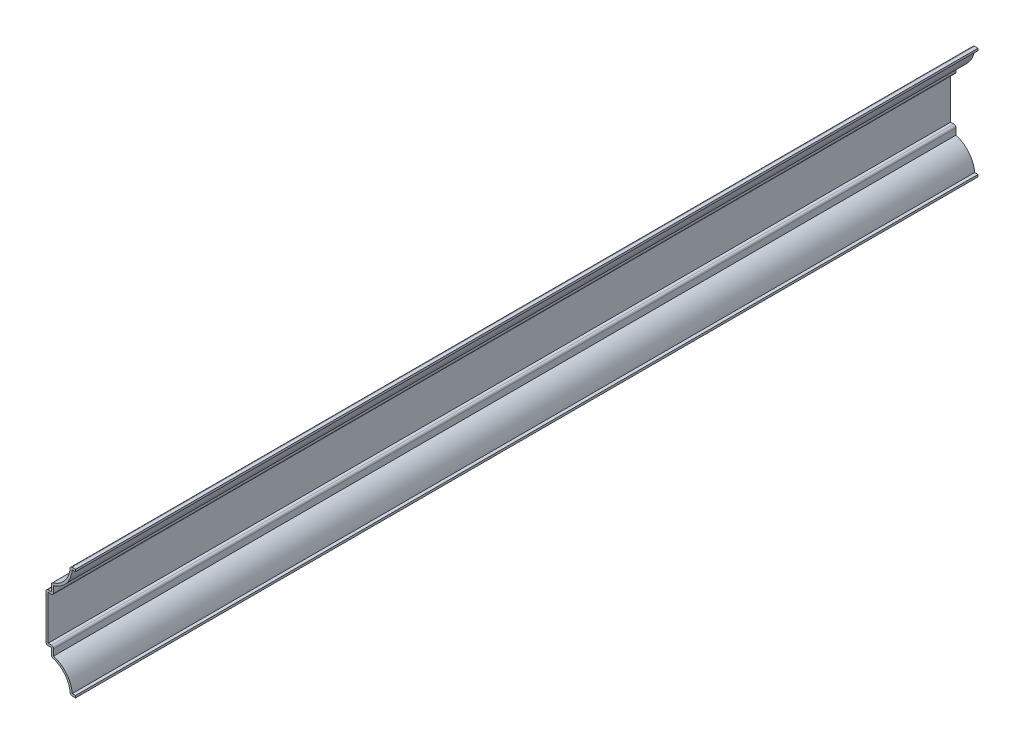
ISO-10303-21;
HEADER;
FILE_DESCRIPTION(('STEP AP214'),'2;1');
FILE_NAME('part.step','',(''),(''),'','','');
FILE_SCHEMA(('AUTOMOTIVE_DESIGN { 1 0 10303 214 1 1 1 1 }'));
ENDSEC;
DATA;
#1=APPLICATION_CONTEXT('core data for automotive mechanical design processes');
#2=APPLICATION_PROTOCOL_DEFINITION('international standard','automotive_design',2000,#1);
#3=PRODUCT_CONTEXT('',#1,'mechanical');
#4=PRODUCT('Part','Part','',(#3));
#5=PRODUCT_RELATED_PRODUCT_CATEGORY('part','',(#4));
#6=PRODUCT_DEFINITION_FORMATION('','',#4);
#7=PRODUCT_DEFINITION_CONTEXT('part definition',#1,'design');
#8=PRODUCT_DEFINITION('design','',#6,#7);
#9=PRODUCT_DEFINITION_SHAPE('','',#8);
#10=(LENGTH_UNIT() NAMED_UNIT(*) SI_UNIT(.MILLI.,.METRE.));
#11=(NAMED_UNIT(*) PLANE_ANGLE_UNIT() SI_UNIT($,.RADIAN.));
#12=(NAMED_UNIT(*) SI_UNIT($,.STERADIAN.) SOLID_ANGLE_UNIT());
#13=UNCERTAINTY_MEASURE_WITH_UNIT(LENGTH_MEASURE(1.E-05),#10,'distance_accuracy_value','');
#14=(GEOMETRIC_REPRESENTATION_CONTEXT(3) GLOBAL_UNCERTAINTY_ASSIGNED_CONTEXT((#13)) GLOBAL_UNIT_ASSIGNED_CONTEXT((#10,
#11,#12)) REPRESENTATION_CONTEXT('',''));
#15=CARTESIAN_POINT('',(0.,0.,0.));
#16=DIRECTION('',(0.,0.,1.));
#17=DIRECTION('',(1.,0.,0.));
#18=AXIS2_PLACEMENT_3D('',#15,#16,#17);
#19=CARTESIAN_POINT('',(0.,0.,-533.4));
#20=DIRECTION('',(0.,-1.,0.));
#21=DIRECTION('',(1.,0.,0.));
#22=AXIS2_PLACEMENT_3D('',#19,#20,#21);
#23=PLANE('',#22);
#24=DIRECTION('',(1.,0.,0.));
#25=VECTOR('',#24,1.);
#26=CARTESIAN_POINT('',(0.,0.,0.));
#27=LINE('',#26,#25);
#28=CARTESIAN_POINT('',(-1.95709004279259,0.,0.));
#29=VERTEX_POINT('',#28);
#30=CARTESIAN_POINT('',(0.,0.,0.));
#31=VERTEX_POINT('',#30);
#32=EDGE_CURVE('E405',#29,#31,#27,.T.);
#33=ORIENTED_EDGE('',*,*,#32,.F.);
#34=DIRECTION('',(0.,0.,1.));
#35=VECTOR('',#34,1.);
#36=CARTESIAN_POINT('',(-1.95709004279259,0.,-533.4));
#37=LINE('',#36,#35);
#38=CARTESIAN_POINT('',(-1.95709004279259,0.,-533.4));
#39=VERTEX_POINT('',#38);
#40=EDGE_CURVE('E229',#29,#39,#37,.F.);
#41=ORIENTED_EDGE('',*,*,#40,.T.);
#42=DIRECTION('',(1.,0.,0.));
#43=VECTOR('',#42,1.);
#44=CARTESIAN_POINT('',(0.,0.,-533.4));
#45=LINE('',#44,#43);
#46=CARTESIAN_POINT('',(0.,0.,-533.4));
#47=VERTEX_POINT('',#46);
#48=EDGE_CURVE('E222',#39,#47,#45,.T.);
#49=ORIENTED_EDGE('',*,*,#48,.T.);
#50=DIRECTION('',(0.,0.,1.));
#51=VECTOR('',#50,1.);
#52=CARTESIAN_POINT('',(0.,0.,-533.4));
#53=LINE('',#52,#51);
#54=EDGE_CURVE('E226',#47,#31,#53,.T.);
#55=ORIENTED_EDGE('',*,*,#54,.T.);
#56=EDGE_LOOP('',(#33,#41,#49,#55));
#57=FACE_BOUND('',#56,.T.);
#58=ADVANCED_FACE('F35',(#57),#23,.T.);
#59=CARTESIAN_POINT('',(-17.412890625,0.,-533.4));
#60=DIRECTION('',(0.,0.,1.));
#61=DIRECTION('',(1.,0.,0.));
#62=AXIS2_PLACEMENT_3D('',#59,#60,#61);
#63=CYLINDRICAL_SURFACE('',#62,14.237890625);
#64=CARTESIAN_POINT('',(-17.412890625,0.,-533.4));
#65=DIRECTION('',(0.,0.,-1.));
#66=DIRECTION('',(1.,0.,0.));
#67=AXIS2_PLACEMENT_3D('',#64,#65,#66);
#68=CIRCLE('',#67,14.237890625);
#69=CARTESIAN_POINT('',(-13.3774552143314,13.6540393472329,-533.4));
#70=VERTEX_POINT('',#69);
#71=CARTESIAN_POINT('',(-3.22282419155942,1.16599488163788,-533.4));
#72=VERTEX_POINT('',#71);
#73=EDGE_CURVE('E246',#70,#72,#68,.T.);
#74=ORIENTED_EDGE('',*,*,#73,.T.);
#75=DIRECTION('',(0.,0.,1.));
#76=VECTOR('',#75,1.);
#77=CARTESIAN_POINT('',(-3.22282419155942,1.16599488163788,-533.4));
#78=LINE('',#77,#76);
#79=CARTESIAN_POINT('',(-3.22282419155942,1.16599488163788,0.));
#80=VERTEX_POINT('',#79);
#81=EDGE_CURVE('E257',#72,#80,#78,.T.);
#82=ORIENTED_EDGE('',*,*,#81,.T.);
#83=CARTESIAN_POINT('',(-17.412890625,0.,0.));
#84=DIRECTION('',(0.,0.,-1.));
#85=DIRECTION('',(1.,0.,0.));
#86=AXIS2_PLACEMENT_3D('',#83,#84,#85);
#87=CIRCLE('',#86,14.237890625);
#88=CARTESIAN_POINT('',(-13.3774552143314,13.6540393472329,0.));
#89=VERTEX_POINT('',#88);
#90=EDGE_CURVE('E232',#89,#80,#87,.T.);
#91=ORIENTED_EDGE('',*,*,#90,.F.);
#92=DIRECTION('',(0.,0.,1.));
#93=VECTOR('',#92,1.);
#94=CARTESIAN_POINT('',(-13.3774552143314,13.6540393472329,-533.4));
#95=LINE('',#94,#93);
#96=EDGE_CURVE('E255',#89,#70,#95,.F.);
#97=ORIENTED_EDGE('',*,*,#96,.T.);
#98=EDGE_LOOP('',(#74,#82,#91,#97));
#99=FACE_BOUND('',#98,.T.);
#100=ADVANCED_FACE('F475',(#99),#63,.F.);
#101=CARTESIAN_POINT('',(-14.2875,13.890625,-533.4));
#102=DIRECTION('',(-1.,0.,0.));
#103=DIRECTION('',(0.,-1.,0.));
#104=AXIS2_PLACEMENT_3D('',#101,#102,#103);
#105=PLANE('',#104);
#106=DIRECTION('',(0.,-1.,0.));
#107=VECTOR('',#106,1.);
#108=CARTESIAN_POINT('',(-14.2875,13.890625,-533.4));
#109=LINE('',#108,#107);
#110=CARTESIAN_POINT('',(-14.2875,18.653125,-533.4));
#111=VERTEX_POINT('',#110);
#112=CARTESIAN_POINT('',(-14.2875,14.8719606269861,-533.4));
#113=VERTEX_POINT('',#112);
#114=EDGE_CURVE('E251',#111,#113,#109,.T.);
#115=ORIENTED_EDGE('',*,*,#114,.T.);
#116=DIRECTION('',(0.,0.,1.));
#117=VECTOR('',#116,1.);
#118=CARTESIAN_POINT('',(-14.2875,14.8719606269861,-533.4));
#119=LINE('',#118,#117);
#120=CARTESIAN_POINT('',(-14.2875,14.8719606269861,0.));
#121=VERTEX_POINT('',#120);
#122=EDGE_CURVE('E293',#113,#121,#119,.T.);
#123=ORIENTED_EDGE('',*,*,#122,.T.);
#124=DIRECTION('',(0.,-1.,0.));
#125=VECTOR('',#124,1.);
#126=CARTESIAN_POINT('',(-14.2875,13.890625,0.));
#127=LINE('',#126,#125);
#128=CARTESIAN_POINT('',(-14.2875,18.653125,0.));
#129=VERTEX_POINT('',#128);
#130=EDGE_CURVE('E364',#129,#121,#127,.T.);
#131=ORIENTED_EDGE('',*,*,#130,.F.);
#132=DIRECTION('',(0.,0.,1.));
#133=VECTOR('',#132,1.);
#134=CARTESIAN_POINT('',(-14.2875,18.653125,-533.4));
#135=LINE('',#134,#133);
#136=EDGE_CURVE('E258',#111,#129,#135,.T.);
#137=ORIENTED_EDGE('',*,*,#136,.F.);
#138=EDGE_LOOP('',(#115,#123,#131,#137));
#139=FACE_BOUND('',#138,.T.);
#140=ADVANCED_FACE('F485',(#139),#105,.T.);
#141=CARTESIAN_POINT('',(-14.2875,18.653125,-533.4));
#142=DIRECTION('',(0.,-1.,0.));
#143=DIRECTION('',(0.,0.,-1.));
#144=AXIS2_PLACEMENT_3D('',#141,#142,#143);
#145=PLANE('',#144);
#146=DIRECTION('',(1.,0.,0.));
#147=VECTOR('',#146,1.);
#148=CARTESIAN_POINT('',(-14.2875,18.653125,0.));
#149=LINE('',#148,#147);
#150=CARTESIAN_POINT('',(-16.1925,18.653125,0.));
#151=VERTEX_POINT('',#150);
#152=EDGE_CURVE('E362',#151,#129,#149,.T.);
#153=ORIENTED_EDGE('',*,*,#152,.F.);
#154=DIRECTION('',(0.,0.,1.));
#155=VECTOR('',#154,1.);
#156=CARTESIAN_POINT('',(-16.1925,18.653125,-533.4));
#157=LINE('',#156,#155);
#158=CARTESIAN_POINT('',(-16.1925,18.653125,-533.4));
#159=VERTEX_POINT('',#158);
#160=EDGE_CURVE('E301',#151,#159,#157,.F.);
#161=ORIENTED_EDGE('',*,*,#160,.T.);
#162=DIRECTION('',(1.,0.,0.));
#163=VECTOR('',#162,1.);
#164=CARTESIAN_POINT('',(-14.2875,18.653125,-533.4));
#165=LINE('',#164,#163);
#166=EDGE_CURVE('E466',#159,#111,#165,.T.);
#167=ORIENTED_EDGE('',*,*,#166,.T.);
#168=ORIENTED_EDGE('',*,*,#136,.T.);
#169=EDGE_LOOP('',(#153,#161,#167,#168));
#170=FACE_BOUND('',#169,.T.);
#171=ADVANCED_FACE('F489',(#170),#145,.T.);
#172=CARTESIAN_POINT('',(-17.4625,18.653125,-533.4));
#173=DIRECTION('',(-1.,0.,0.));
#174=DIRECTION('',(0.,0.,1.));
#175=AXIS2_PLACEMENT_3D('',#172,#173,#174);
#176=PLANE('',#175);
#177=DIRECTION('',(0.,-1.,0.));
#178=VECTOR('',#177,1.);
#179=CARTESIAN_POINT('',(-17.4625,18.653125,-533.4));
#180=LINE('',#179,#178);
#181=CARTESIAN_POINT('',(-17.4625,45.958125,-533.4));
#182=VERTEX_POINT('',#181);
#183=CARTESIAN_POINT('',(-17.4625,19.923125,-533.4));
#184=VERTEX_POINT('',#183);
#185=EDGE_CURVE('E463',#182,#184,#180,.T.);
#186=ORIENTED_EDGE('',*,*,#185,.T.);
#187=DIRECTION('',(0.,0.,1.));
#188=VECTOR('',#187,1.);
#189=CARTESIAN_POINT('',(-17.4625,19.923125,-533.4));
#190=LINE('',#189,#188);
#191=CARTESIAN_POINT('',(-17.4625,19.923125,0.));
#192=VERTEX_POINT('',#191);
#193=EDGE_CURVE('E298',#184,#192,#190,.T.);
#194=ORIENTED_EDGE('',*,*,#193,.T.);
#195=DIRECTION('',(0.,-1.,0.));
#196=VECTOR('',#195,1.);
#197=CARTESIAN_POINT('',(-17.4625,18.653125,0.));
#198=LINE('',#197,#196);
#199=CARTESIAN_POINT('',(-17.4625,45.958125,0.));
#200=VERTEX_POINT('',#199);
#201=EDGE_CURVE('E359',#200,#192,#198,.T.);
#202=ORIENTED_EDGE('',*,*,#201,.F.);
#203=DIRECTION('',(0.,0.,1.));
#204=VECTOR('',#203,1.);
#205=CARTESIAN_POINT('',(-17.4625,45.958125,-533.4));
#206=LINE('',#205,#204);
#207=EDGE_CURVE('E296',#200,#182,#206,.F.);
#208=ORIENTED_EDGE('',*,*,#207,.T.);
#209=EDGE_LOOP('',(#186,#194,#202,#208));
#210=FACE_BOUND('',#209,.T.);
#211=ADVANCED_FACE('F498',(#210),#176,.T.);
#212=CARTESIAN_POINT('',(-14.2875,47.228125,-533.4));
#213=DIRECTION('',(0.,1.,0.));
#214=DIRECTION('',(0.,0.,1.));
#215=AXIS2_PLACEMENT_3D('',#212,#213,#214);
#216=PLANE('',#215);
#217=DIRECTION('',(-1.,0.,0.));
#218=VECTOR('',#217,1.);
#219=CARTESIAN_POINT('',(-14.2875,47.228125,-533.4));
#220=LINE('',#219,#218);
#221=CARTESIAN_POINT('',(-14.2875,47.228125,-533.4));
#222=VERTEX_POINT('',#221);
#223=CARTESIAN_POINT('',(-16.1925,47.228125,-533.4));
#224=VERTEX_POINT('',#223);
#225=EDGE_CURVE('E334',#222,#224,#220,.T.);
#226=ORIENTED_EDGE('',*,*,#225,.T.);
#227=DIRECTION('',(0.,0.,1.));
#228=VECTOR('',#227,1.);
#229=CARTESIAN_POINT('',(-16.1925,47.228125,-533.4));
#230=LINE('',#229,#228);
#231=CARTESIAN_POINT('',(-16.1925,47.228125,0.));
#232=VERTEX_POINT('',#231);
#233=EDGE_CURVE('E307',#224,#232,#230,.T.);
#234=ORIENTED_EDGE('',*,*,#233,.T.);
#235=DIRECTION('',(-1.,0.,0.));
#236=VECTOR('',#235,1.);
#237=CARTESIAN_POINT('',(-14.2875,47.228125,0.));
#238=LINE('',#237,#236);
#239=CARTESIAN_POINT('',(-14.2875,47.228125,0.));
#240=VERTEX_POINT('',#239);
#241=EDGE_CURVE('E351',#240,#232,#238,.T.);
#242=ORIENTED_EDGE('',*,*,#241,.F.);
#243=DIRECTION('',(0.,0.,1.));
#244=VECTOR('',#243,1.);
#245=CARTESIAN_POINT('',(-14.2875,47.228125,-533.4));
#246=LINE('',#245,#244);
#247=EDGE_CURVE('E370',#222,#240,#246,.T.);
#248=ORIENTED_EDGE('',*,*,#247,.F.);
#249=EDGE_LOOP('',(#226,#234,#242,#248));
#250=FACE_BOUND('',#249,.T.);
#251=ADVANCED_FACE('F506',(#250),#216,.T.);
#252=CARTESIAN_POINT('',(-14.2875,51.990625,-533.4));
#253=DIRECTION('',(-1.,0.,0.));
#254=DIRECTION('',(0.,-1.,0.));
#255=AXIS2_PLACEMENT_3D('',#252,#253,#254);
#256=PLANE('',#255);
#257=DIRECTION('',(0.,-1.,0.));
#258=VECTOR('',#257,1.);
#259=CARTESIAN_POINT('',(-14.2875,51.990625,0.));
#260=LINE('',#259,#258);
#261=CARTESIAN_POINT('',(-14.2875,51.0092893730139,0.));
#262=VERTEX_POINT('',#261);
#263=EDGE_CURVE('E327',#262,#240,#260,.T.);
#264=ORIENTED_EDGE('',*,*,#263,.F.);
#265=DIRECTION('',(0.,0.,1.));
#266=VECTOR('',#265,1.);
#267=CARTESIAN_POINT('',(-14.2875,51.0092893730139,-533.4));
#268=LINE('',#267,#266);
#269=CARTESIAN_POINT('',(-14.2875,51.0092893730139,-533.4));
#270=VERTEX_POINT('',#269);
#271=EDGE_CURVE('E43',#262,#270,#268,.F.);
#272=ORIENTED_EDGE('',*,*,#271,.T.);
#273=DIRECTION('',(0.,-1.,0.));
#274=VECTOR('',#273,1.);
#275=CARTESIAN_POINT('',(-14.2875,51.990625,-533.4));
#276=LINE('',#275,#274);
#277=EDGE_CURVE('E325',#270,#222,#276,.T.);
#278=ORIENTED_EDGE('',*,*,#277,.T.);
#279=ORIENTED_EDGE('',*,*,#247,.T.);
#280=EDGE_LOOP('',(#264,#272,#278,#279));
#281=FACE_BOUND('',#280,.T.);
#282=ADVANCED_FACE('F323',(#281),#256,.T.);
#283=CARTESIAN_POINT('',(-17.412890625,65.88125,-533.4));
#284=DIRECTION('',(0.,0.,1.));
#285=DIRECTION('',(1.,0.,0.));
#286=AXIS2_PLACEMENT_3D('',#283,#284,#285);
#287=CYLINDRICAL_SURFACE('',#286,14.237890625);
#288=CARTESIAN_POINT('',(-17.412890625,65.88125,-533.4));
#289=DIRECTION('',(0.,0.,-1.));
#290=DIRECTION('',(-1.,0.,0.));
#291=AXIS2_PLACEMENT_3D('',#288,#289,#290);
#292=CIRCLE('',#291,14.237890625);
#293=CARTESIAN_POINT('',(-3.22282419155941,64.7152551183621,-533.4));
#294=VERTEX_POINT('',#293);
#295=CARTESIAN_POINT('',(-13.3774552143314,52.2272106527671,-533.4));
#296=VERTEX_POINT('',#295);
#297=EDGE_CURVE('E335',#294,#296,#292,.T.);
#298=ORIENTED_EDGE('',*,*,#297,.T.);
#299=DIRECTION('',(0.,0.,1.));
#300=VECTOR('',#299,1.);
#301=CARTESIAN_POINT('',(-13.3774552143314,52.2272106527671,-533.4));
#302=LINE('',#301,#300);
#303=CARTESIAN_POINT('',(-13.3774552143314,52.2272106527671,0.));
#304=VERTEX_POINT('',#303);
#305=EDGE_CURVE('E317',#296,#304,#302,.T.);
#306=ORIENTED_EDGE('',*,*,#305,.T.);
#307=CARTESIAN_POINT('',(-17.412890625,65.88125,0.));
#308=DIRECTION('',(0.,0.,-1.));
#309=DIRECTION('',(-1.,0.,0.));
#310=AXIS2_PLACEMENT_3D('',#307,#308,#309);
#311=CIRCLE('',#310,14.237890625);
#312=CARTESIAN_POINT('',(-3.22282419155941,64.7152551183621,0.));
#313=VERTEX_POINT('',#312);
#314=EDGE_CURVE('E343',#313,#304,#311,.T.);
#315=ORIENTED_EDGE('',*,*,#314,.F.);
#316=DIRECTION('',(0.,0.,1.));
#317=VECTOR('',#316,1.);
#318=CARTESIAN_POINT('',(-3.22282419155941,64.7152551183621,-533.4));
#319=LINE('',#318,#317);
#320=EDGE_CURVE('E315',#313,#294,#319,.F.);
#321=ORIENTED_EDGE('',*,*,#320,.T.);
#322=EDGE_LOOP('',(#298,#306,#315,#321));
#323=FACE_BOUND('',#322,.T.);
#324=ADVANCED_FACE('F342',(#323),#287,.F.);
#325=CARTESIAN_POINT('',(0.,65.88125,-533.4));
#326=DIRECTION('',(0.,1.,0.));
#327=DIRECTION('',(0.,0.,1.));
#328=AXIS2_PLACEMENT_3D('',#325,#326,#327);
#329=PLANE('',#328);
#330=DIRECTION('',(-1.,0.,0.));
#331=VECTOR('',#330,1.);
#332=CARTESIAN_POINT('',(0.,65.88125,-533.4));
#333=LINE('',#332,#331);
#334=CARTESIAN_POINT('',(0.,65.88125,-533.4));
#335=VERTEX_POINT('',#334);
#336=CARTESIAN_POINT('',(-1.95709004279259,65.88125,-533.4));
#337=VERTEX_POINT('',#336);
#338=EDGE_CURVE('E458',#335,#337,#333,.T.);
#339=ORIENTED_EDGE('',*,*,#338,.T.);
#340=DIRECTION('',(0.,0.,1.));
#341=VECTOR('',#340,1.);
#342=CARTESIAN_POINT('',(-1.95709004279259,65.88125,-533.4));
#343=LINE('',#342,#341);
#344=CARTESIAN_POINT('',(-1.95709004279259,65.88125,0.));
#345=VERTEX_POINT('',#344);
#346=EDGE_CURVE('E11',#337,#345,#343,.T.);
#347=ORIENTED_EDGE('',*,*,#346,.T.);
#348=DIRECTION('',(-1.,0.,0.));
#349=VECTOR('',#348,1.);
#350=CARTESIAN_POINT('',(0.,65.88125,0.));
#351=LINE('',#350,#349);
#352=CARTESIAN_POINT('',(0.,65.88125,0.));
#353=VERTEX_POINT('',#352);
#354=EDGE_CURVE('E349',#353,#345,#351,.T.);
#355=ORIENTED_EDGE('',*,*,#354,.F.);
#356=DIRECTION('',(0.,0.,1.));
#357=VECTOR('',#356,1.);
#358=CARTESIAN_POINT('',(0.,65.88125,-533.4));
#359=LINE('',#358,#357);
#360=EDGE_CURVE('E372',#335,#353,#359,.T.);
#361=ORIENTED_EDGE('',*,*,#360,.F.);
#362=EDGE_LOOP('',(#339,#347,#355,#361));
#363=FACE_BOUND('',#362,.T.);
#364=ADVANCED_FACE('F550',(#363),#329,.T.);
#365=CARTESIAN_POINT('',(0.,65.88125,-533.4));
#366=DIRECTION('',(-1.,0.,0.));
#367=DIRECTION('',(0.,0.,1.));
#368=AXIS2_PLACEMENT_3D('',#365,#366,#367);
#369=PLANE('',#368);
#370=DIRECTION('',(0.,-1.,0.));
#371=VECTOR('',#370,1.);
#372=CARTESIAN_POINT('',(0.,65.88125,0.));
#373=LINE('',#372,#371);
#374=CARTESIAN_POINT('',(0.,64.61125,0.));
#375=VERTEX_POINT('',#374);
#376=EDGE_CURVE('E353',#353,#375,#373,.T.);
#377=ORIENTED_EDGE('',*,*,#376,.T.);
#378=DIRECTION('',(0.,0.,1.));
#379=VECTOR('',#378,1.);
#380=CARTESIAN_POINT('',(0.,64.61125,-533.4));
#381=LINE('',#380,#379);
#382=CARTESIAN_POINT('',(0.,64.61125,-533.4));
#383=VERTEX_POINT('',#382);
#384=EDGE_CURVE('E374',#383,#375,#381,.T.);
#385=ORIENTED_EDGE('',*,*,#384,.F.);
#386=DIRECTION('',(0.,-1.,0.));
#387=VECTOR('',#386,1.);
#388=CARTESIAN_POINT('',(0.,65.88125,-533.4));
#389=LINE('',#388,#387);
#390=EDGE_CURVE('E456',#335,#383,#389,.T.);
#391=ORIENTED_EDGE('',*,*,#390,.F.);
#392=ORIENTED_EDGE('',*,*,#360,.T.);
#393=EDGE_LOOP('',(#377,#385,#391,#392));
#394=FACE_BOUND('',#393,.T.);
#395=ADVANCED_FACE('F425',(#394),#369,.F.);
#396=CARTESIAN_POINT('',(0.,64.61125,-533.4));
#397=DIRECTION('',(0.,1.,0.));
#398=DIRECTION('',(0.,0.,1.));
#399=AXIS2_PLACEMENT_3D('',#396,#397,#398);
#400=PLANE('',#399);
#401=DIRECTION('',(1.,0.,0.));
#402=VECTOR('',#401,1.);
#403=CARTESIAN_POINT('',(0.,64.61125,0.));
#404=LINE('',#403,#402);
#405=CARTESIAN_POINT('',(-1.95709004279259,64.61125,0.));
#406=VERTEX_POINT('',#405);
#407=EDGE_CURVE('E421',#375,#406,#404,.F.);
#408=ORIENTED_EDGE('',*,*,#407,.T.);
#409=DIRECTION('',(0.,0.,1.));
#410=VECTOR('',#409,1.);
#411=CARTESIAN_POINT('',(-1.95709004279259,64.61125,-533.4));
#412=LINE('',#411,#410);
#413=CARTESIAN_POINT('',(-1.95709004279259,64.61125,-533.4));
#414=VERTEX_POINT('',#413);
#415=EDGE_CURVE('E377',#414,#406,#412,.T.);
#416=ORIENTED_EDGE('',*,*,#415,.F.);
#417=DIRECTION('',(1.,0.,0.));
#418=VECTOR('',#417,1.);
#419=CARTESIAN_POINT('',(0.,64.61125,-533.4));
#420=LINE('',#419,#418);
#421=EDGE_CURVE('E433',#383,#414,#420,.F.);
#422=ORIENTED_EDGE('',*,*,#421,.F.);
#423=ORIENTED_EDGE('',*,*,#384,.T.);
#424=EDGE_LOOP('',(#408,#416,#422,#423));
#425=FACE_BOUND('',#424,.T.);
#426=ADVANCED_FACE('F431',(#425),#400,.F.);
#427=CARTESIAN_POINT('',(-17.412890625,65.88125,-533.4));
#428=DIRECTION('',(0.,0.,1.));
#429=DIRECTION('',(1.,0.,0.));
#430=AXIS2_PLACEMENT_3D('',#427,#428,#429);
#431=CYLINDRICAL_SURFACE('',#430,15.507890625);
#432=CARTESIAN_POINT('',(-17.412890625,65.88125,0.));
#433=DIRECTION('',(0.,0.,1.));
#434=DIRECTION('',(1.,0.,0.));
#435=AXIS2_PLACEMENT_3D('',#432,#433,#434);
#436=CIRCLE('',#435,15.507890625);
#437=CARTESIAN_POINT('',(-13.0175,51.0092893730139,0.));
#438=VERTEX_POINT('',#437);
#439=EDGE_CURVE('E419',#406,#438,#436,.F.);
#440=ORIENTED_EDGE('',*,*,#439,.T.);
#441=DIRECTION('',(0.,0.,1.));
#442=VECTOR('',#441,1.);
#443=CARTESIAN_POINT('',(-13.0175,51.0092893730139,-533.4));
#444=LINE('',#443,#442);
#445=CARTESIAN_POINT('',(-13.0175,51.0092893730139,-533.4));
#446=VERTEX_POINT('',#445);
#447=EDGE_CURVE('E380',#446,#438,#444,.T.);
#448=ORIENTED_EDGE('',*,*,#447,.F.);
#449=CARTESIAN_POINT('',(-17.412890625,65.88125,-533.4));
#450=DIRECTION('',(0.,0.,1.));
#451=DIRECTION('',(1.,0.,0.));
#452=AXIS2_PLACEMENT_3D('',#449,#450,#451);
#453=CIRCLE('',#452,15.507890625);
#454=EDGE_CURVE('E447',#414,#446,#453,.F.);
#455=ORIENTED_EDGE('',*,*,#454,.F.);
#456=ORIENTED_EDGE('',*,*,#415,.T.);
#457=EDGE_LOOP('',(#440,#448,#455,#456));
#458=FACE_BOUND('',#457,.T.);
#459=ADVANCED_FACE('F438',(#458),#431,.T.);
#460=CARTESIAN_POINT('',(-13.0175,51.990625,-533.4));
#461=DIRECTION('',(-1.,0.,0.));
#462=DIRECTION('',(0.,-1.,0.));
#463=AXIS2_PLACEMENT_3D('',#460,#461,#462);
#464=PLANE('',#463);
#465=DIRECTION('',(0.,-1.,0.));
#466=VECTOR('',#465,1.);
#467=CARTESIAN_POINT('',(-13.0175,51.990625,0.));
#468=LINE('',#467,#466);
#469=CARTESIAN_POINT('',(-13.0175,47.228125,0.));
#470=VERTEX_POINT('',#469);
#471=EDGE_CURVE('E416',#438,#470,#468,.T.);
#472=ORIENTED_EDGE('',*,*,#471,.T.);
#473=DIRECTION('',(0.,0.,1.));
#474=VECTOR('',#473,1.);
#475=CARTESIAN_POINT('',(-13.0175,47.228125,-533.4));
#476=LINE('',#475,#474);
#477=CARTESIAN_POINT('',(-13.0175,47.228125,-533.4));
#478=VERTEX_POINT('',#477);
#479=EDGE_CURVE('E313',#470,#478,#476,.F.);
#480=ORIENTED_EDGE('',*,*,#479,.T.);
#481=DIRECTION('',(0.,-1.,0.));
#482=VECTOR('',#481,1.);
#483=CARTESIAN_POINT('',(-13.0175,51.990625,-533.4));
#484=LINE('',#483,#482);
#485=EDGE_CURVE('E445',#446,#478,#484,.T.);
#486=ORIENTED_EDGE('',*,*,#485,.F.);
#487=ORIENTED_EDGE('',*,*,#447,.T.);
#488=EDGE_LOOP('',(#472,#480,#486,#487));
#489=FACE_BOUND('',#488,.T.);
#490=ADVANCED_FACE('F442',(#489),#464,.F.);
#491=CARTESIAN_POINT('',(-14.2875,45.958125,-533.4));
#492=DIRECTION('',(0.,1.,0.));
#493=DIRECTION('',(0.,0.,1.));
#494=AXIS2_PLACEMENT_3D('',#491,#492,#493);
#495=PLANE('',#494);
#496=DIRECTION('',(1.,0.,0.));
#497=VECTOR('',#496,1.);
#498=CARTESIAN_POINT('',(-14.2875,45.958125,-533.4));
#499=LINE('',#498,#497);
#500=CARTESIAN_POINT('',(-14.2875,45.958125,-533.4));
#501=VERTEX_POINT('',#500);
#502=CARTESIAN_POINT('',(-16.1925,45.958125,-533.4));
#503=VERTEX_POINT('',#502);
#504=EDGE_CURVE('E448',#501,#503,#499,.F.);
#505=ORIENTED_EDGE('',*,*,#504,.F.);
#506=DIRECTION('',(0.,0.,1.));
#507=VECTOR('',#506,1.);
#508=CARTESIAN_POINT('',(-14.2875,45.958125,-533.4));
#509=LINE('',#508,#507);
#510=CARTESIAN_POINT('',(-14.2875,45.958125,0.));
#511=VERTEX_POINT('',#510);
#512=EDGE_CURVE('E310',#501,#511,#509,.T.);
#513=ORIENTED_EDGE('',*,*,#512,.T.);
#514=DIRECTION('',(1.,0.,0.));
#515=VECTOR('',#514,1.);
#516=CARTESIAN_POINT('',(-14.2875,45.958125,0.));
#517=LINE('',#516,#515);
#518=CARTESIAN_POINT('',(-16.1925,45.958125,0.));
#519=VERTEX_POINT('',#518);
#520=EDGE_CURVE('E414',#511,#519,#517,.F.);
#521=ORIENTED_EDGE('',*,*,#520,.T.);
#522=DIRECTION('',(0.,0.,1.));
#523=VECTOR('',#522,1.);
#524=CARTESIAN_POINT('',(-16.1925,45.958125,-533.4));
#525=LINE('',#524,#523);
#526=EDGE_CURVE('E383',#503,#519,#525,.T.);
#527=ORIENTED_EDGE('',*,*,#526,.F.);
#528=EDGE_LOOP('',(#505,#513,#521,#527));
#529=FACE_BOUND('',#528,.T.);
#530=ADVANCED_FACE('F566',(#529),#495,.F.);
#531=CARTESIAN_POINT('',(-16.1925,18.653125,-533.4));
#532=DIRECTION('',(-1.,0.,0.));
#533=DIRECTION('',(0.,0.,1.));
#534=AXIS2_PLACEMENT_3D('',#531,#532,#533);
#535=PLANE('',#534);
#536=DIRECTION('',(0.,1.,0.));
#537=VECTOR('',#536,1.);
#538=CARTESIAN_POINT('',(-16.1925,18.653125,0.));
#539=LINE('',#538,#537);
#540=CARTESIAN_POINT('',(-16.1925,19.923125,0.));
#541=VERTEX_POINT('',#540);
#542=EDGE_CURVE('E412',#519,#541,#539,.F.);
#543=ORIENTED_EDGE('',*,*,#542,.T.);
#544=DIRECTION('',(0.,0.,1.));
#545=VECTOR('',#544,1.);
#546=CARTESIAN_POINT('',(-16.1925,19.923125,-533.4));
#547=LINE('',#546,#545);
#548=CARTESIAN_POINT('',(-16.1925,19.923125,-533.4));
#549=VERTEX_POINT('',#548);
#550=EDGE_CURVE('E386',#549,#541,#547,.T.);
#551=ORIENTED_EDGE('',*,*,#550,.F.);
#552=DIRECTION('',(0.,1.,0.));
#553=VECTOR('',#552,1.);
#554=CARTESIAN_POINT('',(-16.1925,18.653125,-533.4));
#555=LINE('',#554,#553);
#556=EDGE_CURVE('E451',#503,#549,#555,.F.);
#557=ORIENTED_EDGE('',*,*,#556,.F.);
#558=ORIENTED_EDGE('',*,*,#526,.T.);
#559=EDGE_LOOP('',(#543,#551,#557,#558));
#560=FACE_BOUND('',#559,.T.);
#561=ADVANCED_FACE('F569',(#560),#535,.F.);
#562=CARTESIAN_POINT('',(-14.2875,19.923125,-533.4));
#563=DIRECTION('',(0.,-1.,0.));
#564=DIRECTION('',(0.,0.,-1.));
#565=AXIS2_PLACEMENT_3D('',#562,#563,#564);
#566=PLANE('',#565);
#567=DIRECTION('',(1.,0.,0.));
#568=VECTOR('',#567,1.);
#569=CARTESIAN_POINT('',(-14.2875,19.923125,0.));
#570=LINE('',#569,#568);
#571=CARTESIAN_POINT('',(-14.2875,19.923125,0.));
#572=VERTEX_POINT('',#571);
#573=EDGE_CURVE('E410',#541,#572,#570,.T.);
#574=ORIENTED_EDGE('',*,*,#573,.T.);
#575=DIRECTION('',(0.,0.,1.));
#576=VECTOR('',#575,1.);
#577=CARTESIAN_POINT('',(-14.2875,19.923125,-533.4));
#578=LINE('',#577,#576);
#579=CARTESIAN_POINT('',(-14.2875,19.923125,-533.4));
#580=VERTEX_POINT('',#579);
#581=EDGE_CURVE('E58',#572,#580,#578,.F.);
#582=ORIENTED_EDGE('',*,*,#581,.T.);
#583=DIRECTION('',(1.,0.,0.));
#584=VECTOR('',#583,1.);
#585=CARTESIAN_POINT('',(-14.2875,19.923125,-533.4));
#586=LINE('',#585,#584);
#587=EDGE_CURVE('E772',#549,#580,#586,.T.);
#588=ORIENTED_EDGE('',*,*,#587,.F.);
#589=ORIENTED_EDGE('',*,*,#550,.T.);
#590=EDGE_LOOP('',(#574,#582,#588,#589));
#591=FACE_BOUND('',#590,.T.);
#592=ADVANCED_FACE('F573',(#591),#566,.F.);
#593=CARTESIAN_POINT('',(-13.0175,13.890625,-533.4));
#594=DIRECTION('',(-1.,0.,0.));
#595=DIRECTION('',(0.,-1.,0.));
#596=AXIS2_PLACEMENT_3D('',#593,#594,#595);
#597=PLANE('',#596);
#598=DIRECTION('',(0.,-1.,0.));
#599=VECTOR('',#598,1.);
#600=CARTESIAN_POINT('',(-13.0175,13.890625,-533.4));
#601=LINE('',#600,#599);
#602=CARTESIAN_POINT('',(-13.0175,18.653125,-533.4));
#603=VERTEX_POINT('',#602);
#604=CARTESIAN_POINT('',(-13.0175,14.8719606269861,-533.4));
#605=VERTEX_POINT('',#604);
#606=EDGE_CURVE('E767',#603,#605,#601,.T.);
#607=ORIENTED_EDGE('',*,*,#606,.F.);
#608=DIRECTION('',(0.,0.,1.));
#609=VECTOR('',#608,1.);
#610=CARTESIAN_POINT('',(-13.0175,18.653125,-533.4));
#611=LINE('',#610,#609);
#612=CARTESIAN_POINT('',(-13.0175,18.653125,0.));
#613=VERTEX_POINT('',#612);
#614=EDGE_CURVE('E303',#603,#613,#611,.T.);
#615=ORIENTED_EDGE('',*,*,#614,.T.);
#616=DIRECTION('',(0.,-1.,0.));
#617=VECTOR('',#616,1.);
#618=CARTESIAN_POINT('',(-13.0175,13.890625,0.));
#619=LINE('',#618,#617);
#620=CARTESIAN_POINT('',(-13.0175,14.8719606269861,0.));
#621=VERTEX_POINT('',#620);
#622=EDGE_CURVE('E403',#613,#621,#619,.T.);
#623=ORIENTED_EDGE('',*,*,#622,.T.);
#624=DIRECTION('',(0.,0.,1.));
#625=VECTOR('',#624,1.);
#626=CARTESIAN_POINT('',(-13.0175,14.8719606269861,-533.4));
#627=LINE('',#626,#625);
#628=EDGE_CURVE('E389',#605,#621,#627,.T.);
#629=ORIENTED_EDGE('',*,*,#628,.F.);
#630=EDGE_LOOP('',(#607,#615,#623,#629));
#631=FACE_BOUND('',#630,.T.);
#632=ADVANCED_FACE('F577',(#631),#597,.F.);
#633=CARTESIAN_POINT('',(-17.412890625,0.,-533.4));
#634=DIRECTION('',(0.,0.,1.));
#635=DIRECTION('',(1.,0.,0.));
#636=AXIS2_PLACEMENT_3D('',#633,#634,#635);
#637=CYLINDRICAL_SURFACE('',#636,15.507890625);
#638=CARTESIAN_POINT('',(-17.412890625,0.,0.));
#639=DIRECTION('',(0.,0.,1.));
#640=DIRECTION('',(1.,0.,0.));
#641=AXIS2_PLACEMENT_3D('',#638,#639,#640);
#642=CIRCLE('',#641,15.507890625);
#643=CARTESIAN_POINT('',(-1.95709004279259,1.27,0.));
#644=VERTEX_POINT('',#643);
#645=EDGE_CURVE('E401',#621,#644,#642,.F.);
#646=ORIENTED_EDGE('',*,*,#645,.T.);
#647=DIRECTION('',(0.,0.,1.));
#648=VECTOR('',#647,1.);
#649=CARTESIAN_POINT('',(-1.95709004279259,1.27,-533.4));
#650=LINE('',#649,#648);
#651=CARTESIAN_POINT('',(-1.95709004279259,1.27,-533.4));
#652=VERTEX_POINT('',#651);
#653=EDGE_CURVE('E248',#652,#644,#650,.T.);
#654=ORIENTED_EDGE('',*,*,#653,.F.);
#655=CARTESIAN_POINT('',(-17.412890625,0.,-533.4));
#656=DIRECTION('',(0.,0.,1.));
#657=DIRECTION('',(1.,0.,0.));
#658=AXIS2_PLACEMENT_3D('',#655,#656,#657);
#659=CIRCLE('',#658,15.507890625);
#660=EDGE_CURVE('E766',#605,#652,#659,.F.);
#661=ORIENTED_EDGE('',*,*,#660,.F.);
#662=ORIENTED_EDGE('',*,*,#628,.T.);
#663=EDGE_LOOP('',(#646,#654,#661,#662));
#664=FACE_BOUND('',#663,.T.);
#665=ADVANCED_FACE('F580',(#664),#637,.T.);
#666=CARTESIAN_POINT('',(0.,1.27,-533.4));
#667=DIRECTION('',(0.,-1.,0.));
#668=DIRECTION('',(1.,0.,0.));
#669=AXIS2_PLACEMENT_3D('',#666,#667,#668);
#670=PLANE('',#669);
#671=DIRECTION('',(1.,0.,0.));
#672=VECTOR('',#671,1.);
#673=CARTESIAN_POINT('',(0.,1.27,0.));
#674=LINE('',#673,#672);
#675=CARTESIAN_POINT('',(0.,1.27,0.));
#676=VERTEX_POINT('',#675);
#677=EDGE_CURVE('E396',#644,#676,#674,.T.);
#678=ORIENTED_EDGE('',*,*,#677,.T.);
#679=DIRECTION('',(0.,0.,1.));
#680=VECTOR('',#679,1.);
#681=CARTESIAN_POINT('',(0.,1.27,-533.4));
#682=LINE('',#681,#680);
#683=CARTESIAN_POINT('',(0.,1.27,-533.4));
#684=VERTEX_POINT('',#683);
#685=EDGE_CURVE('E245',#684,#676,#682,.T.);
#686=ORIENTED_EDGE('',*,*,#685,.F.);
#687=DIRECTION('',(1.,0.,0.));
#688=VECTOR('',#687,1.);
#689=CARTESIAN_POINT('',(0.,1.27,-533.4));
#690=LINE('',#689,#688);
#691=EDGE_CURVE('E237',#652,#684,#690,.T.);
#692=ORIENTED_EDGE('',*,*,#691,.F.);
#693=ORIENTED_EDGE('',*,*,#653,.T.);
#694=EDGE_LOOP('',(#678,#686,#692,#693));
#695=FACE_BOUND('',#694,.T.);
#696=ADVANCED_FACE('F395',(#695),#670,.F.);
#697=CARTESIAN_POINT('',(0.,1.27,-533.4));
#698=DIRECTION('',(-1.,0.,0.));
#699=DIRECTION('',(0.,-1.,0.));
#700=AXIS2_PLACEMENT_3D('',#697,#698,#699);
#701=PLANE('',#700);
#702=DIRECTION('',(0.,-1.,0.));
#703=VECTOR('',#702,1.);
#704=CARTESIAN_POINT('',(0.,1.27,0.));
#705=LINE('',#704,#703);
#706=EDGE_CURVE('E244',#676,#31,#705,.T.);
#707=ORIENTED_EDGE('',*,*,#706,.T.);
#708=ORIENTED_EDGE('',*,*,#54,.F.);
#709=DIRECTION('',(0.,-1.,0.));
#710=VECTOR('',#709,1.);
#711=CARTESIAN_POINT('',(0.,1.27,-533.4));
#712=LINE('',#711,#710);
#713=EDGE_CURVE('E231',#684,#47,#712,.T.);
#714=ORIENTED_EDGE('',*,*,#713,.F.);
#715=ORIENTED_EDGE('',*,*,#685,.T.);
#716=EDGE_LOOP('',(#707,#708,#714,#715));
#717=FACE_BOUND('',#716,.T.);
#718=ADVANCED_FACE('F242',(#717),#701,.F.);
#719=CARTESIAN_POINT('',(-17.412890625,0.,-533.4));
#720=DIRECTION('',(0.,0.,1.));
#721=DIRECTION('',(1.,0.,0.));
#722=AXIS2_PLACEMENT_3D('',#719,#720,#721);
#723=PLANE('',#722);
#724=ORIENTED_EDGE('',*,*,#48,.F.);
#725=CARTESIAN_POINT('',(-1.95709004279259,1.27,-533.4));
#726=DIRECTION('',(0.,0.,1.));
#727=DIRECTION('',(1.,0.,0.));
#728=AXIS2_PLACEMENT_3D('',#725,#726,#727);
#729=CIRCLE('',#728,1.27);
#730=EDGE_CURVE('E291',#39,#72,#729,.F.);
#731=ORIENTED_EDGE('',*,*,#730,.T.);
#732=ORIENTED_EDGE('',*,*,#73,.F.);
#733=CARTESIAN_POINT('',(-13.0175,14.8719606269861,-533.4));
#734=DIRECTION('',(0.,0.,1.));
#735=DIRECTION('',(1.,0.,0.));
#736=AXIS2_PLACEMENT_3D('',#733,#734,#735);
#737=CIRCLE('',#736,1.27);
#738=EDGE_CURVE('E289',#70,#113,#737,.F.);
#739=ORIENTED_EDGE('',*,*,#738,.T.);
#740=ORIENTED_EDGE('',*,*,#114,.F.);
#741=ORIENTED_EDGE('',*,*,#166,.F.);
#742=CARTESIAN_POINT('',(-16.1925,19.923125,-533.4));
#743=DIRECTION('',(0.,0.,1.));
#744=DIRECTION('',(1.,0.,0.));
#745=AXIS2_PLACEMENT_3D('',#742,#743,#744);
#746=CIRCLE('',#745,1.27);
#747=EDGE_CURVE('E287',#159,#184,#746,.F.);
#748=ORIENTED_EDGE('',*,*,#747,.T.);
#749=ORIENTED_EDGE('',*,*,#185,.F.);
#750=CARTESIAN_POINT('',(-16.1925,45.958125,-533.4));
#751=DIRECTION('',(0.,0.,1.));
#752=DIRECTION('',(1.,0.,0.));
#753=AXIS2_PLACEMENT_3D('',#750,#751,#752);
#754=CIRCLE('',#753,1.27);
#755=EDGE_CURVE('E284',#182,#224,#754,.F.);
#756=ORIENTED_EDGE('',*,*,#755,.T.);
#757=ORIENTED_EDGE('',*,*,#225,.F.);
#758=ORIENTED_EDGE('',*,*,#277,.F.);
#759=CARTESIAN_POINT('',(-13.0175,51.0092893730139,-533.4));
#760=DIRECTION('',(0.,0.,1.));
#761=DIRECTION('',(1.,0.,0.));
#762=AXIS2_PLACEMENT_3D('',#759,#760,#761);
#763=CIRCLE('',#762,1.27);
#764=EDGE_CURVE('E280',#270,#296,#763,.F.);
#765=ORIENTED_EDGE('',*,*,#764,.T.);
#766=ORIENTED_EDGE('',*,*,#297,.F.);
#767=CARTESIAN_POINT('',(-1.95709004279259,64.61125,-533.4));
#768=DIRECTION('',(0.,0.,1.));
#769=DIRECTION('',(1.,0.,0.));
#770=AXIS2_PLACEMENT_3D('',#767,#768,#769);
#771=CIRCLE('',#770,1.27);
#772=EDGE_CURVE('E278',#294,#337,#771,.F.);
#773=ORIENTED_EDGE('',*,*,#772,.T.);
#774=ORIENTED_EDGE('',*,*,#338,.F.);
#775=ORIENTED_EDGE('',*,*,#390,.T.);
#776=ORIENTED_EDGE('',*,*,#421,.T.);
#777=ORIENTED_EDGE('',*,*,#454,.T.);
#778=ORIENTED_EDGE('',*,*,#485,.T.);
#779=CARTESIAN_POINT('',(-14.2875,47.228125,-533.4));
#780=DIRECTION('',(0.,0.,1.));
#781=DIRECTION('',(1.,0.,0.));
#782=AXIS2_PLACEMENT_3D('',#779,#780,#781);
#783=CIRCLE('',#782,1.27);
#784=EDGE_CURVE('E282',#478,#501,#783,.F.);
#785=ORIENTED_EDGE('',*,*,#784,.T.);
#786=ORIENTED_EDGE('',*,*,#504,.T.);
#787=ORIENTED_EDGE('',*,*,#556,.T.);
#788=ORIENTED_EDGE('',*,*,#587,.T.);
#789=CARTESIAN_POINT('',(-14.2875,18.653125,-533.4));
#790=DIRECTION('',(0.,0.,1.));
#791=DIRECTION('',(1.,0.,0.));
#792=AXIS2_PLACEMENT_3D('',#789,#790,#791);
#793=CIRCLE('',#792,1.27);
#794=EDGE_CURVE('E50',#580,#603,#793,.F.);
#795=ORIENTED_EDGE('',*,*,#794,.T.);
#796=ORIENTED_EDGE('',*,*,#606,.T.);
#797=ORIENTED_EDGE('',*,*,#660,.T.);
#798=ORIENTED_EDGE('',*,*,#691,.T.);
#799=ORIENTED_EDGE('',*,*,#713,.T.);
#800=EDGE_LOOP('',(#724,#731,#732,#739,#740,#741,#748,#749,#756,#757,#758,#765,#766,#773,#774,
#775,#776,#777,#778,#785,#786,#787,#788,#795,#796,#797,#798,#799));
#801=FACE_BOUND('',#800,.T.);
#802=ADVANCED_FACE('F235',(#801),#723,.F.);
#803=CARTESIAN_POINT('',(-17.412890625,0.,0.));
#804=DIRECTION('',(0.,0.,1.));
#805=DIRECTION('',(1.,0.,0.));
#806=AXIS2_PLACEMENT_3D('',#803,#804,#805);
#807=PLANE('',#806);
#808=ORIENTED_EDGE('',*,*,#90,.T.);
#809=CARTESIAN_POINT('',(-1.95709004279259,1.27,0.));
#810=DIRECTION('',(0.,0.,1.));
#811=DIRECTION('',(1.,0.,0.));
#812=AXIS2_PLACEMENT_3D('',#809,#810,#811);
#813=CIRCLE('',#812,1.27);
#814=EDGE_CURVE('E275',#80,#29,#813,.T.);
#815=ORIENTED_EDGE('',*,*,#814,.T.);
#816=ORIENTED_EDGE('',*,*,#32,.T.);
#817=ORIENTED_EDGE('',*,*,#706,.F.);
#818=ORIENTED_EDGE('',*,*,#677,.F.);
#819=ORIENTED_EDGE('',*,*,#645,.F.);
#820=ORIENTED_EDGE('',*,*,#622,.F.);
#821=CARTESIAN_POINT('',(-14.2875,18.653125,0.));
#822=DIRECTION('',(0.,0.,1.));
#823=DIRECTION('',(1.,0.,0.));
#824=AXIS2_PLACEMENT_3D('',#821,#822,#823);
#825=CIRCLE('',#824,1.27);
#826=EDGE_CURVE('E269',#613,#572,#825,.T.);
#827=ORIENTED_EDGE('',*,*,#826,.T.);
#828=ORIENTED_EDGE('',*,*,#573,.F.);
#829=ORIENTED_EDGE('',*,*,#542,.F.);
#830=ORIENTED_EDGE('',*,*,#520,.F.);
#831=CARTESIAN_POINT('',(-14.2875,47.228125,0.));
#832=DIRECTION('',(0.,0.,1.));
#833=DIRECTION('',(1.,0.,0.));
#834=AXIS2_PLACEMENT_3D('',#831,#832,#833);
#835=CIRCLE('',#834,1.27);
#836=EDGE_CURVE('E265',#511,#470,#835,.T.);
#837=ORIENTED_EDGE('',*,*,#836,.T.);
#838=ORIENTED_EDGE('',*,*,#471,.F.);
#839=ORIENTED_EDGE('',*,*,#439,.F.);
#840=ORIENTED_EDGE('',*,*,#407,.F.);
#841=ORIENTED_EDGE('',*,*,#376,.F.);
#842=ORIENTED_EDGE('',*,*,#354,.T.);
#843=CARTESIAN_POINT('',(-1.95709004279259,64.61125,0.));
#844=DIRECTION('',(0.,0.,1.));
#845=DIRECTION('',(1.,0.,0.));
#846=AXIS2_PLACEMENT_3D('',#843,#844,#845);
#847=CIRCLE('',#846,1.27);
#848=EDGE_CURVE('E261',#345,#313,#847,.T.);
#849=ORIENTED_EDGE('',*,*,#848,.T.);
#850=ORIENTED_EDGE('',*,*,#314,.T.);
#851=CARTESIAN_POINT('',(-13.0175,51.0092893730139,0.));
#852=DIRECTION('',(0.,0.,1.));
#853=DIRECTION('',(1.,0.,0.));
#854=AXIS2_PLACEMENT_3D('',#851,#852,#853);
#855=CIRCLE('',#854,1.27);
#856=EDGE_CURVE('E263',#304,#262,#855,.T.);
#857=ORIENTED_EDGE('',*,*,#856,.T.);
#858=ORIENTED_EDGE('',*,*,#263,.T.);
#859=ORIENTED_EDGE('',*,*,#241,.T.);
#860=CARTESIAN_POINT('',(-16.1925,45.958125,0.));
#861=DIRECTION('',(0.,0.,1.));
#862=DIRECTION('',(1.,0.,0.));
#863=AXIS2_PLACEMENT_3D('',#860,#861,#862);
#864=CIRCLE('',#863,1.27);
#865=EDGE_CURVE('E267',#232,#200,#864,.T.);
#866=ORIENTED_EDGE('',*,*,#865,.T.);
#867=ORIENTED_EDGE('',*,*,#201,.T.);
#868=CARTESIAN_POINT('',(-16.1925,19.923125,0.));
#869=DIRECTION('',(0.,0.,1.));
#870=DIRECTION('',(1.,0.,0.));
#871=AXIS2_PLACEMENT_3D('',#868,#869,#870);
#872=CIRCLE('',#871,1.27);
#873=EDGE_CURVE('E271',#192,#151,#872,.T.);
#874=ORIENTED_EDGE('',*,*,#873,.T.);
#875=ORIENTED_EDGE('',*,*,#152,.T.);
#876=ORIENTED_EDGE('',*,*,#130,.T.);
#877=CARTESIAN_POINT('',(-13.0175,14.8719606269861,0.));
#878=DIRECTION('',(0.,0.,1.));
#879=DIRECTION('',(1.,0.,0.));
#880=AXIS2_PLACEMENT_3D('',#877,#878,#879);
#881=CIRCLE('',#880,1.27);
#882=EDGE_CURVE('E273',#121,#89,#881,.T.);
#883=ORIENTED_EDGE('',*,*,#882,.T.);
#884=EDGE_LOOP('',(#808,#815,#816,#817,#818,#819,#820,#827,#828,#829,#830,#837,#838,#839,#840,
#841,#842,#849,#850,#857,#858,#859,#866,#867,#874,#875,#876,#883));
#885=FACE_BOUND('',#884,.T.);
#886=ADVANCED_FACE('F347',(#885),#807,.T.);
#887=CARTESIAN_POINT('',(-1.95709004279259,1.27,-533.4));
#888=DIRECTION('',(0.,0.,1.));
#889=DIRECTION('',(1.,0.,0.));
#890=AXIS2_PLACEMENT_3D('',#887,#888,#889);
#891=CYLINDRICAL_SURFACE('',#890,1.27);
#892=ORIENTED_EDGE('',*,*,#730,.F.);
#893=ORIENTED_EDGE('',*,*,#40,.F.);
#894=ORIENTED_EDGE('',*,*,#814,.F.);
#895=ORIENTED_EDGE('',*,*,#81,.F.);
#896=EDGE_LOOP('',(#892,#893,#894,#895));
#897=FACE_BOUND('',#896,.T.);
#898=ADVANCED_FACE('F470',(#897),#891,.T.);
#899=CARTESIAN_POINT('',(-13.0175,14.8719606269861,-533.4));
#900=DIRECTION('',(0.,0.,1.));
#901=DIRECTION('',(1.,0.,0.));
#902=AXIS2_PLACEMENT_3D('',#899,#900,#901);
#903=CYLINDRICAL_SURFACE('',#902,1.27);
#904=ORIENTED_EDGE('',*,*,#738,.F.);
#905=ORIENTED_EDGE('',*,*,#96,.F.);
#906=ORIENTED_EDGE('',*,*,#882,.F.);
#907=ORIENTED_EDGE('',*,*,#122,.F.);
#908=EDGE_LOOP('',(#904,#905,#906,#907));
#909=FACE_BOUND('',#908,.T.);
#910=ADVANCED_FACE('F479',(#909),#903,.T.);
#911=CARTESIAN_POINT('',(-16.1925,19.923125,-533.4));
#912=DIRECTION('',(0.,0.,1.));
#913=DIRECTION('',(1.,0.,0.));
#914=AXIS2_PLACEMENT_3D('',#911,#912,#913);
#915=CYLINDRICAL_SURFACE('',#914,1.27);
#916=ORIENTED_EDGE('',*,*,#747,.F.);
#917=ORIENTED_EDGE('',*,*,#160,.F.);
#918=ORIENTED_EDGE('',*,*,#873,.F.);
#919=ORIENTED_EDGE('',*,*,#193,.F.);
#920=EDGE_LOOP('',(#916,#917,#918,#919));
#921=FACE_BOUND('',#920,.T.);
#922=ADVANCED_FACE('F495',(#921),#915,.T.);
#923=CARTESIAN_POINT('',(-14.2875,18.653125,-533.4));
#924=DIRECTION('',(0.,0.,1.));
#925=DIRECTION('',(1.,0.,0.));
#926=AXIS2_PLACEMENT_3D('',#923,#924,#925);
#927=CYLINDRICAL_SURFACE('',#926,1.27);
#928=ORIENTED_EDGE('',*,*,#794,.F.);
#929=ORIENTED_EDGE('',*,*,#581,.F.);
#930=ORIENTED_EDGE('',*,*,#826,.F.);
#931=ORIENTED_EDGE('',*,*,#614,.F.);
#932=EDGE_LOOP('',(#928,#929,#930,#931));
#933=FACE_BOUND('',#932,.T.);
#934=ADVANCED_FACE('F530',(#933),#927,.T.);
#935=CARTESIAN_POINT('',(-16.1925,45.958125,-533.4));
#936=DIRECTION('',(0.,0.,1.));
#937=DIRECTION('',(1.,0.,0.));
#938=AXIS2_PLACEMENT_3D('',#935,#936,#937);
#939=CYLINDRICAL_SURFACE('',#938,1.27);
#940=ORIENTED_EDGE('',*,*,#755,.F.);
#941=ORIENTED_EDGE('',*,*,#207,.F.);
#942=ORIENTED_EDGE('',*,*,#865,.F.);
#943=ORIENTED_EDGE('',*,*,#233,.F.);
#944=EDGE_LOOP('',(#940,#941,#942,#943));
#945=FACE_BOUND('',#944,.T.);
#946=ADVANCED_FACE('F504',(#945),#939,.T.);
#947=CARTESIAN_POINT('',(-14.2875,47.228125,-533.4));
#948=DIRECTION('',(0.,0.,1.));
#949=DIRECTION('',(1.,0.,0.));
#950=AXIS2_PLACEMENT_3D('',#947,#948,#949);
#951=CYLINDRICAL_SURFACE('',#950,1.27);
#952=ORIENTED_EDGE('',*,*,#784,.F.);
#953=ORIENTED_EDGE('',*,*,#479,.F.);
#954=ORIENTED_EDGE('',*,*,#836,.F.);
#955=ORIENTED_EDGE('',*,*,#512,.F.);
#956=EDGE_LOOP('',(#952,#953,#954,#955));
#957=FACE_BOUND('',#956,.T.);
#958=ADVANCED_FACE('F536',(#957),#951,.T.);
#959=CARTESIAN_POINT('',(-13.0175,51.0092893730139,-533.4));
#960=DIRECTION('',(0.,0.,1.));
#961=DIRECTION('',(1.,0.,0.));
#962=AXIS2_PLACEMENT_3D('',#959,#960,#961);
#963=CYLINDRICAL_SURFACE('',#962,1.27);
#964=ORIENTED_EDGE('',*,*,#764,.F.);
#965=ORIENTED_EDGE('',*,*,#271,.F.);
#966=ORIENTED_EDGE('',*,*,#856,.F.);
#967=ORIENTED_EDGE('',*,*,#305,.F.);
#968=EDGE_LOOP('',(#964,#965,#966,#967));
#969=FACE_BOUND('',#968,.T.);
#970=ADVANCED_FACE('F338',(#969),#963,.T.);
#971=CARTESIAN_POINT('',(-1.95709004279259,64.61125,-533.4));
#972=DIRECTION('',(0.,0.,1.));
#973=DIRECTION('',(1.,0.,0.));
#974=AXIS2_PLACEMENT_3D('',#971,#972,#973);
#975=CYLINDRICAL_SURFACE('',#974,1.27);
#976=ORIENTED_EDGE('',*,*,#772,.F.);
#977=ORIENTED_EDGE('',*,*,#320,.F.);
#978=ORIENTED_EDGE('',*,*,#848,.F.);
#979=ORIENTED_EDGE('',*,*,#346,.F.);
#980=EDGE_LOOP('',(#976,#977,#978,#979));
#981=FACE_BOUND('',#980,.T.);
#982=ADVANCED_FACE('F37',(#981),#975,.T.);
#983=CLOSED_SHELL('',(#58,#100,#140,#171,#211,#251,#282,#324,#364,#395,#426,#459,#490,#530,#561,
#592,#632,#665,#696,#718,#802,#886,#898,#910,#922,#934,#946,#958,#970,#982));
#984=MANIFOLD_SOLID_BREP('B2',#983);
#985=ADVANCED_BREP_SHAPE_REPRESENTATION('',(#18,#984),#14);
#986=SHAPE_DEFINITION_REPRESENTATION(#9,#985);
ENDSEC;
END-ISO-10303-21;
